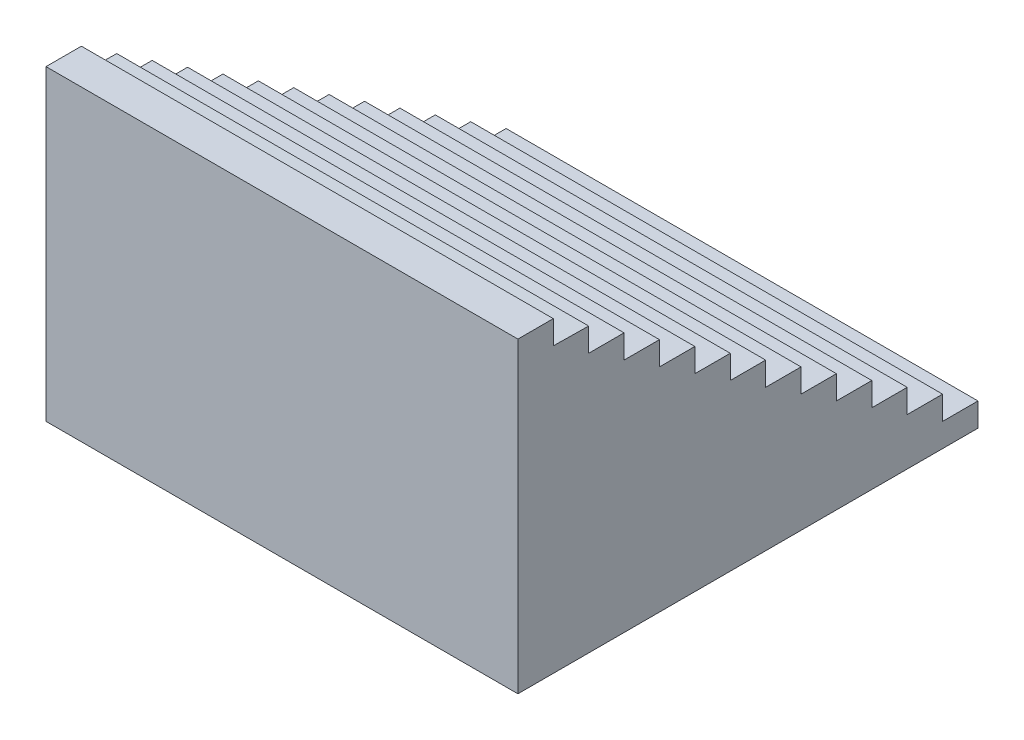
ISO-10303-21;
HEADER;
FILE_DESCRIPTION(('STEP AP214'),'2;1');
FILE_NAME('part.step','',(''),(''),'','','');
FILE_SCHEMA(('AUTOMOTIVE_DESIGN { 1 0 10303 214 1 1 1 1 }'));
ENDSEC;
DATA;
#1=APPLICATION_CONTEXT('core data for automotive mechanical design processes');
#2=APPLICATION_PROTOCOL_DEFINITION('international standard','automotive_design',2000,#1);
#3=PRODUCT_CONTEXT('',#1,'mechanical');
#4=PRODUCT('Part','Part','',(#3));
#5=PRODUCT_RELATED_PRODUCT_CATEGORY('part','',(#4));
#6=PRODUCT_DEFINITION_FORMATION('','',#4);
#7=PRODUCT_DEFINITION_CONTEXT('part definition',#1,'design');
#8=PRODUCT_DEFINITION('design','',#6,#7);
#9=PRODUCT_DEFINITION_SHAPE('','',#8);
#10=(LENGTH_UNIT() NAMED_UNIT(*) SI_UNIT(.MILLI.,.METRE.));
#11=(NAMED_UNIT(*) PLANE_ANGLE_UNIT() SI_UNIT($,.RADIAN.));
#12=(NAMED_UNIT(*) SI_UNIT($,.STERADIAN.) SOLID_ANGLE_UNIT());
#13=UNCERTAINTY_MEASURE_WITH_UNIT(LENGTH_MEASURE(1.E-05),#10,'distance_accuracy_value','');
#14=(GEOMETRIC_REPRESENTATION_CONTEXT(3) GLOBAL_UNCERTAINTY_ASSIGNED_CONTEXT((#13)) GLOBAL_UNIT_ASSIGNED_CONTEXT((#10,
#11,#12)) REPRESENTATION_CONTEXT('',''));
#15=CARTESIAN_POINT('',(0.,0.,0.));
#16=DIRECTION('',(0.,0.,1.));
#17=DIRECTION('',(1.,0.,0.));
#18=AXIS2_PLACEMENT_3D('',#15,#16,#17);
#19=CARTESIAN_POINT('',(-200.,65.2131457703675,60.));
#20=DIRECTION('',(0.,0.,-1.));
#21=DIRECTION('',(-1.,0.,0.));
#22=AXIS2_PLACEMENT_3D('',#19,#20,#21);
#23=PLANE('',#22);
#24=DIRECTION('',(0.,1.,0.));
#25=VECTOR('',#24,1.);
#26=CARTESIAN_POINT('',(0.,65.2131457703675,60.));
#27=LINE('',#26,#25);
#28=CARTESIAN_POINT('',(0.,55.2131457703675,60.));
#29=VERTEX_POINT('',#28);
#30=CARTESIAN_POINT('',(0.,65.2131457703675,60.));
#31=VERTEX_POINT('',#30);
#32=EDGE_CURVE('E262',#29,#31,#27,.T.);
#33=ORIENTED_EDGE('',*,*,#32,.F.);
#34=DIRECTION('',(1.,0.,0.));
#35=VECTOR('',#34,1.);
#36=CARTESIAN_POINT('',(-200.,55.2131457703675,60.));
#37=LINE('',#36,#35);
#38=CARTESIAN_POINT('',(-200.,55.2131457703675,60.));
#39=VERTEX_POINT('',#38);
#40=EDGE_CURVE('E11',#39,#29,#37,.T.);
#41=ORIENTED_EDGE('',*,*,#40,.F.);
#42=DIRECTION('',(0.,1.,0.));
#43=VECTOR('',#42,1.);
#44=CARTESIAN_POINT('',(-200.,65.2131457703675,60.));
#45=LINE('',#44,#43);
#46=CARTESIAN_POINT('',(-200.,65.2131457703675,60.));
#47=VERTEX_POINT('',#46);
#48=EDGE_CURVE('E370',#39,#47,#45,.T.);
#49=ORIENTED_EDGE('',*,*,#48,.T.);
#50=DIRECTION('',(1.,0.,0.));
#51=VECTOR('',#50,1.);
#52=CARTESIAN_POINT('',(-200.,65.2131457703675,60.));
#53=LINE('',#52,#51);
#54=EDGE_CURVE('E42',#47,#31,#53,.T.);
#55=ORIENTED_EDGE('',*,*,#54,.T.);
#56=EDGE_LOOP('',(#33,#41,#49,#55));
#57=FACE_BOUND('',#56,.T.);
#58=ADVANCED_FACE('F39',(#57),#23,.T.);
#59=CARTESIAN_POINT('',(-200.,55.2131457703675,60.));
#60=DIRECTION('',(0.,0.99989905724305,-0.0142082836563894));
#61=DIRECTION('',(0.,0.0142082836563894,0.99989905724305));
#62=AXIS2_PLACEMENT_3D('',#59,#60,#61);
#63=PLANE('',#62);
#64=DIRECTION('',(0.,0.0142082836563894,0.99989905724305));
#65=VECTOR('',#64,1.);
#66=CARTESIAN_POINT('',(0.,55.2131457703675,60.));
#67=LINE('',#66,#65);
#68=CARTESIAN_POINT('',(0.,55.0000215155217,45.0015141413543));
#69=VERTEX_POINT('',#68);
#70=EDGE_CURVE('E367',#69,#29,#67,.T.);
#71=ORIENTED_EDGE('',*,*,#70,.F.);
#72=DIRECTION('',(1.,0.,0.));
#73=VECTOR('',#72,1.);
#74=CARTESIAN_POINT('',(-200.,55.0000215155217,45.0015141413543));
#75=LINE('',#74,#73);
#76=CARTESIAN_POINT('',(-200.,55.0000215155217,45.0015141413543));
#77=VERTEX_POINT('',#76);
#78=EDGE_CURVE('E49',#77,#69,#75,.T.);
#79=ORIENTED_EDGE('',*,*,#78,.F.);
#80=DIRECTION('',(0.,0.0142082836563894,0.99989905724305));
#81=VECTOR('',#80,1.);
#82=CARTESIAN_POINT('',(-200.,55.2131457703675,60.));
#83=LINE('',#82,#81);
#84=EDGE_CURVE('E248',#77,#39,#83,.T.);
#85=ORIENTED_EDGE('',*,*,#84,.T.);
#86=ORIENTED_EDGE('',*,*,#40,.T.);
#87=EDGE_LOOP('',(#71,#79,#85,#86));
#88=FACE_BOUND('',#87,.T.);
#89=ADVANCED_FACE('F448',(#88),#63,.T.);
#90=CARTESIAN_POINT('',(-200.,55.0000215155217,45.0015141413543));
#91=DIRECTION('',(0.,0.,-1.));
#92=DIRECTION('',(-1.,0.,0.));
#93=AXIS2_PLACEMENT_3D('',#90,#91,#92);
#94=PLANE('',#93);
#95=DIRECTION('',(0.,1.,0.));
#96=VECTOR('',#95,1.);
#97=CARTESIAN_POINT('',(0.,55.0000215155217,45.0015141413543));
#98=LINE('',#97,#96);
#99=CARTESIAN_POINT('',(0.,45.0000215155217,45.0015141413543));
#100=VERTEX_POINT('',#99);
#101=EDGE_CURVE('E234',#100,#69,#98,.T.);
#102=ORIENTED_EDGE('',*,*,#101,.F.);
#103=DIRECTION('',(1.,0.,0.));
#104=VECTOR('',#103,1.);
#105=CARTESIAN_POINT('',(-200.,45.0000215155217,45.0015141413543));
#106=LINE('',#105,#104);
#107=CARTESIAN_POINT('',(-200.,45.0000215155217,45.0015141413543));
#108=VERTEX_POINT('',#107);
#109=EDGE_CURVE('E229',#108,#100,#106,.T.);
#110=ORIENTED_EDGE('',*,*,#109,.F.);
#111=DIRECTION('',(0.,1.,0.));
#112=VECTOR('',#111,1.);
#113=CARTESIAN_POINT('',(-200.,55.0000215155217,45.0015141413543));
#114=LINE('',#113,#112);
#115=EDGE_CURVE('E232',#108,#77,#114,.T.);
#116=ORIENTED_EDGE('',*,*,#115,.T.);
#117=ORIENTED_EDGE('',*,*,#78,.T.);
#118=EDGE_LOOP('',(#102,#110,#116,#117));
#119=FACE_BOUND('',#118,.T.);
#120=ADVANCED_FACE('F231',(#119),#94,.T.);
#121=CARTESIAN_POINT('',(-200.,45.0000215155217,45.0015141413543));
#122=DIRECTION('',(0.,1.,0.));
#123=DIRECTION('',(0.,0.,1.));
#124=AXIS2_PLACEMENT_3D('',#121,#122,#123);
#125=PLANE('',#124);
#126=DIRECTION('',(0.,0.,1.));
#127=VECTOR('',#126,1.);
#128=CARTESIAN_POINT('',(0.,45.0000215155217,45.0015141413543));
#129=LINE('',#128,#127);
#130=CARTESIAN_POINT('',(0.,45.0000215155217,30.0015141413543));
#131=VERTEX_POINT('',#130);
#132=EDGE_CURVE('E362',#131,#100,#129,.T.);
#133=ORIENTED_EDGE('',*,*,#132,.F.);
#134=DIRECTION('',(1.,0.,0.));
#135=VECTOR('',#134,1.);
#136=CARTESIAN_POINT('',(-200.,45.0000215155217,30.0015141413543));
#137=LINE('',#136,#135);
#138=CARTESIAN_POINT('',(-200.,45.0000215155217,30.0015141413543));
#139=VERTEX_POINT('',#138);
#140=EDGE_CURVE('E240',#139,#131,#137,.T.);
#141=ORIENTED_EDGE('',*,*,#140,.F.);
#142=DIRECTION('',(0.,0.,1.));
#143=VECTOR('',#142,1.);
#144=CARTESIAN_POINT('',(-200.,45.0000215155217,45.0015141413543));
#145=LINE('',#144,#143);
#146=EDGE_CURVE('E246',#139,#108,#145,.T.);
#147=ORIENTED_EDGE('',*,*,#146,.T.);
#148=ORIENTED_EDGE('',*,*,#109,.T.);
#149=EDGE_LOOP('',(#133,#141,#147,#148));
#150=FACE_BOUND('',#149,.T.);
#151=ADVANCED_FACE('F251',(#150),#125,.T.);
#152=CARTESIAN_POINT('',(-200.,45.0000215155217,30.0015141413543));
#153=DIRECTION('',(0.,0.,-1.));
#154=DIRECTION('',(-1.,0.,0.));
#155=AXIS2_PLACEMENT_3D('',#152,#153,#154);
#156=PLANE('',#155);
#157=DIRECTION('',(0.,1.,0.));
#158=VECTOR('',#157,1.);
#159=CARTESIAN_POINT('',(0.,45.0000215155217,30.0015141413543));
#160=LINE('',#159,#158);
#161=CARTESIAN_POINT('',(0.,35.0000215155217,30.0015141413543));
#162=VERTEX_POINT('',#161);
#163=EDGE_CURVE('E358',#162,#131,#160,.T.);
#164=ORIENTED_EDGE('',*,*,#163,.F.);
#165=DIRECTION('',(1.,0.,0.));
#166=VECTOR('',#165,1.);
#167=CARTESIAN_POINT('',(-200.,35.0000215155217,30.0015141413543));
#168=LINE('',#167,#166);
#169=CARTESIAN_POINT('',(-200.,35.0000215155217,30.0015141413543));
#170=VERTEX_POINT('',#169);
#171=EDGE_CURVE('E376',#170,#162,#168,.T.);
#172=ORIENTED_EDGE('',*,*,#171,.F.);
#173=DIRECTION('',(0.,1.,0.));
#174=VECTOR('',#173,1.);
#175=CARTESIAN_POINT('',(-200.,45.0000215155217,30.0015141413543));
#176=LINE('',#175,#174);
#177=EDGE_CURVE('E253',#170,#139,#176,.T.);
#178=ORIENTED_EDGE('',*,*,#177,.T.);
#179=ORIENTED_EDGE('',*,*,#140,.T.);
#180=EDGE_LOOP('',(#164,#172,#178,#179));
#181=FACE_BOUND('',#180,.T.);
#182=ADVANCED_FACE('F461',(#181),#156,.T.);
#183=CARTESIAN_POINT('',(-200.,35.0000215155217,30.0015141413543));
#184=DIRECTION('',(0.,1.,0.));
#185=DIRECTION('',(0.,0.,1.));
#186=AXIS2_PLACEMENT_3D('',#183,#184,#185);
#187=PLANE('',#186);
#188=DIRECTION('',(0.,0.,1.));
#189=VECTOR('',#188,1.);
#190=CARTESIAN_POINT('',(0.,35.0000215155217,30.0015141413543));
#191=LINE('',#190,#189);
#192=CARTESIAN_POINT('',(0.,35.0000215155217,15.0015141413543));
#193=VERTEX_POINT('',#192);
#194=EDGE_CURVE('E354',#193,#162,#191,.T.);
#195=ORIENTED_EDGE('',*,*,#194,.F.);
#196=DIRECTION('',(1.,0.,0.));
#197=VECTOR('',#196,1.);
#198=CARTESIAN_POINT('',(-200.,35.0000215155217,15.0015141413543));
#199=LINE('',#198,#197);
#200=CARTESIAN_POINT('',(-200.,35.0000215155217,15.0015141413543));
#201=VERTEX_POINT('',#200);
#202=EDGE_CURVE('E379',#201,#193,#199,.T.);
#203=ORIENTED_EDGE('',*,*,#202,.F.);
#204=DIRECTION('',(0.,0.,1.));
#205=VECTOR('',#204,1.);
#206=CARTESIAN_POINT('',(-200.,35.0000215155217,30.0015141413543));
#207=LINE('',#206,#205);
#208=EDGE_CURVE('E256',#201,#170,#207,.T.);
#209=ORIENTED_EDGE('',*,*,#208,.T.);
#210=ORIENTED_EDGE('',*,*,#171,.T.);
#211=EDGE_LOOP('',(#195,#203,#209,#210));
#212=FACE_BOUND('',#211,.T.);
#213=ADVANCED_FACE('F464',(#212),#187,.T.);
#214=CARTESIAN_POINT('',(-200.,35.0000215155217,15.0015141413543));
#215=DIRECTION('',(0.,0.,-1.));
#216=DIRECTION('',(-1.,0.,0.));
#217=AXIS2_PLACEMENT_3D('',#214,#215,#216);
#218=PLANE('',#217);
#219=DIRECTION('',(0.,1.,0.));
#220=VECTOR('',#219,1.);
#221=CARTESIAN_POINT('',(0.,35.0000215155217,15.0015141413543));
#222=LINE('',#221,#220);
#223=CARTESIAN_POINT('',(0.,25.0000215155217,15.0015141413543));
#224=VERTEX_POINT('',#223);
#225=EDGE_CURVE('E350',#224,#193,#222,.T.);
#226=ORIENTED_EDGE('',*,*,#225,.F.);
#227=DIRECTION('',(1.,0.,0.));
#228=VECTOR('',#227,1.);
#229=CARTESIAN_POINT('',(-200.,25.0000215155217,15.0015141413543));
#230=LINE('',#229,#228);
#231=CARTESIAN_POINT('',(-200.,25.0000215155217,15.0015141413543));
#232=VERTEX_POINT('',#231);
#233=EDGE_CURVE('E382',#232,#224,#230,.T.);
#234=ORIENTED_EDGE('',*,*,#233,.F.);
#235=DIRECTION('',(0.,1.,0.));
#236=VECTOR('',#235,1.);
#237=CARTESIAN_POINT('',(-200.,35.0000215155217,15.0015141413543));
#238=LINE('',#237,#236);
#239=EDGE_CURVE('E809',#232,#201,#238,.T.);
#240=ORIENTED_EDGE('',*,*,#239,.T.);
#241=ORIENTED_EDGE('',*,*,#202,.T.);
#242=EDGE_LOOP('',(#226,#234,#240,#241));
#243=FACE_BOUND('',#242,.T.);
#244=ADVANCED_FACE('F468',(#243),#218,.T.);
#245=CARTESIAN_POINT('',(-200.,25.0000215155217,15.0015141413543));
#246=DIRECTION('',(0.,1.,0.));
#247=DIRECTION('',(0.,0.,1.));
#248=AXIS2_PLACEMENT_3D('',#245,#246,#247);
#249=PLANE('',#248);
#250=DIRECTION('',(0.,0.,1.));
#251=VECTOR('',#250,1.);
#252=CARTESIAN_POINT('',(0.,25.0000215155217,15.0015141413543));
#253=LINE('',#252,#251);
#254=CARTESIAN_POINT('',(0.,25.0000215155217,0.00151414135425576));
#255=VERTEX_POINT('',#254);
#256=EDGE_CURVE('E346',#255,#224,#253,.T.);
#257=ORIENTED_EDGE('',*,*,#256,.F.);
#258=DIRECTION('',(1.,0.,0.));
#259=VECTOR('',#258,1.);
#260=CARTESIAN_POINT('',(-200.,25.0000215155217,0.00151414135425576));
#261=LINE('',#260,#259);
#262=CARTESIAN_POINT('',(-200.,25.0000215155217,0.00151414135425576));
#263=VERTEX_POINT('',#262);
#264=EDGE_CURVE('E385',#263,#255,#261,.T.);
#265=ORIENTED_EDGE('',*,*,#264,.F.);
#266=DIRECTION('',(0.,0.,1.));
#267=VECTOR('',#266,1.);
#268=CARTESIAN_POINT('',(-200.,25.0000215155217,15.0015141413543));
#269=LINE('',#268,#267);
#270=EDGE_CURVE('E805',#263,#232,#269,.T.);
#271=ORIENTED_EDGE('',*,*,#270,.T.);
#272=ORIENTED_EDGE('',*,*,#233,.T.);
#273=EDGE_LOOP('',(#257,#265,#271,#272));
#274=FACE_BOUND('',#273,.T.);
#275=ADVANCED_FACE('F472',(#274),#249,.T.);
#276=CARTESIAN_POINT('',(-200.,25.0000215155217,0.00151414135425576));
#277=DIRECTION('',(0.,0.,-1.));
#278=DIRECTION('',(0.,1.,0.));
#279=AXIS2_PLACEMENT_3D('',#276,#277,#278);
#280=PLANE('',#279);
#281=DIRECTION('',(0.,1.,0.));
#282=VECTOR('',#281,1.);
#283=CARTESIAN_POINT('',(0.,25.0000215155217,0.00151414135425576));
#284=LINE('',#283,#282);
#285=CARTESIAN_POINT('',(0.,15.0000215155217,0.00151414135425454));
#286=VERTEX_POINT('',#285);
#287=EDGE_CURVE('E342',#286,#255,#284,.T.);
#288=ORIENTED_EDGE('',*,*,#287,.F.);
#289=DIRECTION('',(1.,0.,0.));
#290=VECTOR('',#289,1.);
#291=CARTESIAN_POINT('',(-200.,15.0000215155217,0.00151414135425454));
#292=LINE('',#291,#290);
#293=CARTESIAN_POINT('',(-200.,15.0000215155217,0.00151414135425454));
#294=VERTEX_POINT('',#293);
#295=EDGE_CURVE('E388',#294,#286,#292,.T.);
#296=ORIENTED_EDGE('',*,*,#295,.F.);
#297=DIRECTION('',(0.,1.,0.));
#298=VECTOR('',#297,1.);
#299=CARTESIAN_POINT('',(-200.,25.0000215155217,0.00151414135425576));
#300=LINE('',#299,#298);
#301=EDGE_CURVE('E819',#294,#263,#300,.T.);
#302=ORIENTED_EDGE('',*,*,#301,.T.);
#303=ORIENTED_EDGE('',*,*,#264,.T.);
#304=EDGE_LOOP('',(#288,#296,#302,#303));
#305=FACE_BOUND('',#304,.T.);
#306=ADVANCED_FACE('F476',(#305),#280,.T.);
#307=CARTESIAN_POINT('',(-200.,15.0000215155217,0.00151414135425454));
#308=DIRECTION('',(0.,1.,0.));
#309=DIRECTION('',(0.,0.,1.));
#310=AXIS2_PLACEMENT_3D('',#307,#308,#309);
#311=PLANE('',#310);
#312=DIRECTION('',(0.,0.,1.));
#313=VECTOR('',#312,1.);
#314=CARTESIAN_POINT('',(0.,15.0000215155217,0.00151414135425454));
#315=LINE('',#314,#313);
#316=CARTESIAN_POINT('',(0.,15.0000215155217,-14.9984858586457));
#317=VERTEX_POINT('',#316);
#318=EDGE_CURVE('E338',#317,#286,#315,.T.);
#319=ORIENTED_EDGE('',*,*,#318,.F.);
#320=DIRECTION('',(1.,0.,0.));
#321=VECTOR('',#320,1.);
#322=CARTESIAN_POINT('',(-200.,15.0000215155217,-14.9984858586457));
#323=LINE('',#322,#321);
#324=CARTESIAN_POINT('',(-200.,15.0000215155217,-14.9984858586457));
#325=VERTEX_POINT('',#324);
#326=EDGE_CURVE('E391',#325,#317,#323,.T.);
#327=ORIENTED_EDGE('',*,*,#326,.F.);
#328=DIRECTION('',(0.,0.,1.));
#329=VECTOR('',#328,1.);
#330=CARTESIAN_POINT('',(-200.,15.0000215155217,0.00151414135425454));
#331=LINE('',#330,#329);
#332=EDGE_CURVE('E798',#325,#294,#331,.T.);
#333=ORIENTED_EDGE('',*,*,#332,.T.);
#334=ORIENTED_EDGE('',*,*,#295,.T.);
#335=EDGE_LOOP('',(#319,#327,#333,#334));
#336=FACE_BOUND('',#335,.T.);
#337=ADVANCED_FACE('F480',(#336),#311,.T.);
#338=CARTESIAN_POINT('',(-200.,15.0000215155217,-14.9984858586457));
#339=DIRECTION('',(0.,0.,-1.));
#340=DIRECTION('',(0.,1.,0.));
#341=AXIS2_PLACEMENT_3D('',#338,#339,#340);
#342=PLANE('',#341);
#343=DIRECTION('',(0.,1.,0.));
#344=VECTOR('',#343,1.);
#345=CARTESIAN_POINT('',(0.,15.0000215155217,-14.9984858586457));
#346=LINE('',#345,#344);
#347=CARTESIAN_POINT('',(0.,5.00002151552168,-14.9984858586457));
#348=VERTEX_POINT('',#347);
#349=EDGE_CURVE('E334',#348,#317,#346,.T.);
#350=ORIENTED_EDGE('',*,*,#349,.F.);
#351=DIRECTION('',(1.,0.,0.));
#352=VECTOR('',#351,1.);
#353=CARTESIAN_POINT('',(-200.,5.00002151552168,-14.9984858586457));
#354=LINE('',#353,#352);
#355=CARTESIAN_POINT('',(-200.,5.00002151552168,-14.9984858586457));
#356=VERTEX_POINT('',#355);
#357=EDGE_CURVE('E394',#356,#348,#354,.T.);
#358=ORIENTED_EDGE('',*,*,#357,.F.);
#359=DIRECTION('',(0.,1.,0.));
#360=VECTOR('',#359,1.);
#361=CARTESIAN_POINT('',(-200.,15.0000215155217,-14.9984858586457));
#362=LINE('',#361,#360);
#363=EDGE_CURVE('E794',#356,#325,#362,.T.);
#364=ORIENTED_EDGE('',*,*,#363,.T.);
#365=ORIENTED_EDGE('',*,*,#326,.T.);
#366=EDGE_LOOP('',(#350,#358,#364,#365));
#367=FACE_BOUND('',#366,.T.);
#368=ADVANCED_FACE('F484',(#367),#342,.T.);
#369=CARTESIAN_POINT('',(-200.,5.00002151552168,-14.9984858586457));
#370=DIRECTION('',(0.,1.,0.));
#371=DIRECTION('',(0.,0.,1.));
#372=AXIS2_PLACEMENT_3D('',#369,#370,#371);
#373=PLANE('',#372);
#374=DIRECTION('',(0.,0.,1.));
#375=VECTOR('',#374,1.);
#376=CARTESIAN_POINT('',(0.,5.00002151552168,-14.9984858586457));
#377=LINE('',#376,#375);
#378=CARTESIAN_POINT('',(0.,5.00002151552168,-29.9984858586458));
#379=VERTEX_POINT('',#378);
#380=EDGE_CURVE('E330',#379,#348,#377,.T.);
#381=ORIENTED_EDGE('',*,*,#380,.F.);
#382=DIRECTION('',(1.,0.,0.));
#383=VECTOR('',#382,1.);
#384=CARTESIAN_POINT('',(-200.,5.00002151552168,-29.9984858586458));
#385=LINE('',#384,#383);
#386=CARTESIAN_POINT('',(-200.,5.00002151552168,-29.9984858586458));
#387=VERTEX_POINT('',#386);
#388=EDGE_CURVE('E397',#387,#379,#385,.T.);
#389=ORIENTED_EDGE('',*,*,#388,.F.);
#390=DIRECTION('',(0.,0.,1.));
#391=VECTOR('',#390,1.);
#392=CARTESIAN_POINT('',(-200.,5.00002151552168,-14.9984858586457));
#393=LINE('',#392,#391);
#394=EDGE_CURVE('E826',#387,#356,#393,.T.);
#395=ORIENTED_EDGE('',*,*,#394,.T.);
#396=ORIENTED_EDGE('',*,*,#357,.T.);
#397=EDGE_LOOP('',(#381,#389,#395,#396));
#398=FACE_BOUND('',#397,.T.);
#399=ADVANCED_FACE('F488',(#398),#373,.T.);
#400=CARTESIAN_POINT('',(-200.,5.00002151552168,-29.9984858586458));
#401=DIRECTION('',(0.,0.,-1.));
#402=DIRECTION('',(-1.,0.,0.));
#403=AXIS2_PLACEMENT_3D('',#400,#401,#402);
#404=PLANE('',#403);
#405=DIRECTION('',(0.,1.,0.));
#406=VECTOR('',#405,1.);
#407=CARTESIAN_POINT('',(0.,5.00002151552168,-29.9984858586458));
#408=LINE('',#407,#406);
#409=CARTESIAN_POINT('',(0.,-4.99997848447832,-29.9984858586458));
#410=VERTEX_POINT('',#409);
#411=EDGE_CURVE('E326',#410,#379,#408,.T.);
#412=ORIENTED_EDGE('',*,*,#411,.F.);
#413=DIRECTION('',(1.,0.,0.));
#414=VECTOR('',#413,1.);
#415=CARTESIAN_POINT('',(-200.,-4.99997848447832,-29.9984858586458));
#416=LINE('',#415,#414);
#417=CARTESIAN_POINT('',(-200.,-4.99997848447832,-29.9984858586458));
#418=VERTEX_POINT('',#417);
#419=EDGE_CURVE('E400',#418,#410,#416,.T.);
#420=ORIENTED_EDGE('',*,*,#419,.F.);
#421=DIRECTION('',(0.,1.,0.));
#422=VECTOR('',#421,1.);
#423=CARTESIAN_POINT('',(-200.,5.00002151552168,-29.9984858586458));
#424=LINE('',#423,#422);
#425=EDGE_CURVE('E787',#418,#387,#424,.T.);
#426=ORIENTED_EDGE('',*,*,#425,.T.);
#427=ORIENTED_EDGE('',*,*,#388,.T.);
#428=EDGE_LOOP('',(#412,#420,#426,#427));
#429=FACE_BOUND('',#428,.T.);
#430=ADVANCED_FACE('F492',(#429),#404,.T.);
#431=CARTESIAN_POINT('',(-200.,-4.99997848447832,-29.9984858586458));
#432=DIRECTION('',(0.,1.,0.));
#433=DIRECTION('',(0.,0.,1.));
#434=AXIS2_PLACEMENT_3D('',#431,#432,#433);
#435=PLANE('',#434);
#436=DIRECTION('',(0.,0.,1.));
#437=VECTOR('',#436,1.);
#438=CARTESIAN_POINT('',(0.,-4.99997848447832,-29.9984858586458));
#439=LINE('',#438,#437);
#440=CARTESIAN_POINT('',(0.,-4.99997848447832,-44.9984858586458));
#441=VERTEX_POINT('',#440);
#442=EDGE_CURVE('E322',#441,#410,#439,.T.);
#443=ORIENTED_EDGE('',*,*,#442,.F.);
#444=DIRECTION('',(1.,0.,0.));
#445=VECTOR('',#444,1.);
#446=CARTESIAN_POINT('',(-200.,-4.99997848447832,-44.9984858586458));
#447=LINE('',#446,#445);
#448=CARTESIAN_POINT('',(-200.,-4.99997848447832,-44.9984858586458));
#449=VERTEX_POINT('',#448);
#450=EDGE_CURVE('E403',#449,#441,#447,.T.);
#451=ORIENTED_EDGE('',*,*,#450,.F.);
#452=DIRECTION('',(0.,0.,1.));
#453=VECTOR('',#452,1.);
#454=CARTESIAN_POINT('',(-200.,-4.99997848447832,-29.9984858586458));
#455=LINE('',#454,#453);
#456=EDGE_CURVE('E783',#449,#418,#455,.T.);
#457=ORIENTED_EDGE('',*,*,#456,.T.);
#458=ORIENTED_EDGE('',*,*,#419,.T.);
#459=EDGE_LOOP('',(#443,#451,#457,#458));
#460=FACE_BOUND('',#459,.T.);
#461=ADVANCED_FACE('F496',(#460),#435,.T.);
#462=CARTESIAN_POINT('',(-200.,-4.99997848447832,-44.9984858586458));
#463=DIRECTION('',(0.,0.,-1.));
#464=DIRECTION('',(-1.,0.,0.));
#465=AXIS2_PLACEMENT_3D('',#462,#463,#464);
#466=PLANE('',#465);
#467=DIRECTION('',(0.,1.,0.));
#468=VECTOR('',#467,1.);
#469=CARTESIAN_POINT('',(0.,-4.99997848447832,-44.9984858586458));
#470=LINE('',#469,#468);
#471=CARTESIAN_POINT('',(0.,-14.9999784844783,-44.9984858586458));
#472=VERTEX_POINT('',#471);
#473=EDGE_CURVE('E318',#472,#441,#470,.T.);
#474=ORIENTED_EDGE('',*,*,#473,.F.);
#475=DIRECTION('',(1.,0.,0.));
#476=VECTOR('',#475,1.);
#477=CARTESIAN_POINT('',(-200.,-14.9999784844783,-44.9984858586458));
#478=LINE('',#477,#476);
#479=CARTESIAN_POINT('',(-200.,-14.9999784844783,-44.9984858586458));
#480=VERTEX_POINT('',#479);
#481=EDGE_CURVE('E406',#480,#472,#478,.T.);
#482=ORIENTED_EDGE('',*,*,#481,.F.);
#483=DIRECTION('',(0.,1.,0.));
#484=VECTOR('',#483,1.);
#485=CARTESIAN_POINT('',(-200.,-4.99997848447832,-44.9984858586458));
#486=LINE('',#485,#484);
#487=EDGE_CURVE('E833',#480,#449,#486,.T.);
#488=ORIENTED_EDGE('',*,*,#487,.T.);
#489=ORIENTED_EDGE('',*,*,#450,.T.);
#490=EDGE_LOOP('',(#474,#482,#488,#489));
#491=FACE_BOUND('',#490,.T.);
#492=ADVANCED_FACE('F500',(#491),#466,.T.);
#493=CARTESIAN_POINT('',(-200.,-14.9999784844783,-44.9984858586458));
#494=DIRECTION('',(0.,1.,0.));
#495=DIRECTION('',(0.,0.,1.));
#496=AXIS2_PLACEMENT_3D('',#493,#494,#495);
#497=PLANE('',#496);
#498=DIRECTION('',(0.,0.,1.));
#499=VECTOR('',#498,1.);
#500=CARTESIAN_POINT('',(0.,-14.9999784844783,-44.9984858586458));
#501=LINE('',#500,#499);
#502=CARTESIAN_POINT('',(0.,-14.9999784844783,-59.9984858586458));
#503=VERTEX_POINT('',#502);
#504=EDGE_CURVE('E314',#503,#472,#501,.T.);
#505=ORIENTED_EDGE('',*,*,#504,.F.);
#506=DIRECTION('',(1.,0.,0.));
#507=VECTOR('',#506,1.);
#508=CARTESIAN_POINT('',(-200.,-14.9999784844783,-59.9984858586458));
#509=LINE('',#508,#507);
#510=CARTESIAN_POINT('',(-200.,-14.9999784844783,-59.9984858586458));
#511=VERTEX_POINT('',#510);
#512=EDGE_CURVE('E409',#511,#503,#509,.T.);
#513=ORIENTED_EDGE('',*,*,#512,.F.);
#514=DIRECTION('',(0.,0.,1.));
#515=VECTOR('',#514,1.);
#516=CARTESIAN_POINT('',(-200.,-14.9999784844783,-44.9984858586458));
#517=LINE('',#516,#515);
#518=EDGE_CURVE('E776',#511,#480,#517,.T.);
#519=ORIENTED_EDGE('',*,*,#518,.T.);
#520=ORIENTED_EDGE('',*,*,#481,.T.);
#521=EDGE_LOOP('',(#505,#513,#519,#520));
#522=FACE_BOUND('',#521,.T.);
#523=ADVANCED_FACE('F504',(#522),#497,.T.);
#524=CARTESIAN_POINT('',(-200.,-14.9999784844783,-59.9984858586458));
#525=DIRECTION('',(0.,0.,-1.));
#526=DIRECTION('',(-1.,0.,0.));
#527=AXIS2_PLACEMENT_3D('',#524,#525,#526);
#528=PLANE('',#527);
#529=DIRECTION('',(0.,1.,0.));
#530=VECTOR('',#529,1.);
#531=CARTESIAN_POINT('',(0.,-14.9999784844783,-59.9984858586458));
#532=LINE('',#531,#530);
#533=CARTESIAN_POINT('',(0.,-24.9999784844783,-59.9984858586458));
#534=VERTEX_POINT('',#533);
#535=EDGE_CURVE('E310',#534,#503,#532,.T.);
#536=ORIENTED_EDGE('',*,*,#535,.F.);
#537=DIRECTION('',(1.,0.,0.));
#538=VECTOR('',#537,1.);
#539=CARTESIAN_POINT('',(-200.,-24.9999784844783,-59.9984858586458));
#540=LINE('',#539,#538);
#541=CARTESIAN_POINT('',(-200.,-24.9999784844783,-59.9984858586458));
#542=VERTEX_POINT('',#541);
#543=EDGE_CURVE('E412',#542,#534,#540,.T.);
#544=ORIENTED_EDGE('',*,*,#543,.F.);
#545=DIRECTION('',(0.,1.,0.));
#546=VECTOR('',#545,1.);
#547=CARTESIAN_POINT('',(-200.,-14.9999784844783,-59.9984858586458));
#548=LINE('',#547,#546);
#549=EDGE_CURVE('E772',#542,#511,#548,.T.);
#550=ORIENTED_EDGE('',*,*,#549,.T.);
#551=ORIENTED_EDGE('',*,*,#512,.T.);
#552=EDGE_LOOP('',(#536,#544,#550,#551));
#553=FACE_BOUND('',#552,.T.);
#554=ADVANCED_FACE('F508',(#553),#528,.T.);
#555=CARTESIAN_POINT('',(-200.,-24.9999784844783,-59.9984858586458));
#556=DIRECTION('',(0.,1.,0.));
#557=DIRECTION('',(0.,0.,1.));
#558=AXIS2_PLACEMENT_3D('',#555,#556,#557);
#559=PLANE('',#558);
#560=DIRECTION('',(0.,0.,1.));
#561=VECTOR('',#560,1.);
#562=CARTESIAN_POINT('',(0.,-24.9999784844783,-59.9984858586458));
#563=LINE('',#562,#561);
#564=CARTESIAN_POINT('',(0.,-24.9999784844783,-74.9984858586457));
#565=VERTEX_POINT('',#564);
#566=EDGE_CURVE('E306',#565,#534,#563,.T.);
#567=ORIENTED_EDGE('',*,*,#566,.F.);
#568=DIRECTION('',(1.,0.,0.));
#569=VECTOR('',#568,1.);
#570=CARTESIAN_POINT('',(-200.,-24.9999784844783,-74.9984858586457));
#571=LINE('',#570,#569);
#572=CARTESIAN_POINT('',(-200.,-24.9999784844783,-74.9984858586457));
#573=VERTEX_POINT('',#572);
#574=EDGE_CURVE('E415',#573,#565,#571,.T.);
#575=ORIENTED_EDGE('',*,*,#574,.F.);
#576=DIRECTION('',(0.,0.,1.));
#577=VECTOR('',#576,1.);
#578=CARTESIAN_POINT('',(-200.,-24.9999784844783,-59.9984858586458));
#579=LINE('',#578,#577);
#580=EDGE_CURVE('E840',#573,#542,#579,.T.);
#581=ORIENTED_EDGE('',*,*,#580,.T.);
#582=ORIENTED_EDGE('',*,*,#543,.T.);
#583=EDGE_LOOP('',(#567,#575,#581,#582));
#584=FACE_BOUND('',#583,.T.);
#585=ADVANCED_FACE('F512',(#584),#559,.T.);
#586=CARTESIAN_POINT('',(-200.,-24.9999784844783,-74.9984858586457));
#587=DIRECTION('',(0.,0.,-1.));
#588=DIRECTION('',(-1.,0.,0.));
#589=AXIS2_PLACEMENT_3D('',#586,#587,#588);
#590=PLANE('',#589);
#591=DIRECTION('',(0.,1.,0.));
#592=VECTOR('',#591,1.);
#593=CARTESIAN_POINT('',(0.,-24.9999784844783,-74.9984858586457));
#594=LINE('',#593,#592);
#595=CARTESIAN_POINT('',(0.,-34.9999784844783,-74.9984858586457));
#596=VERTEX_POINT('',#595);
#597=EDGE_CURVE('E302',#596,#565,#594,.T.);
#598=ORIENTED_EDGE('',*,*,#597,.F.);
#599=DIRECTION('',(1.,0.,0.));
#600=VECTOR('',#599,1.);
#601=CARTESIAN_POINT('',(-200.,-34.9999784844783,-74.9984858586457));
#602=LINE('',#601,#600);
#603=CARTESIAN_POINT('',(-200.,-34.9999784844783,-74.9984858586457));
#604=VERTEX_POINT('',#603);
#605=EDGE_CURVE('E418',#604,#596,#602,.T.);
#606=ORIENTED_EDGE('',*,*,#605,.F.);
#607=DIRECTION('',(0.,1.,0.));
#608=VECTOR('',#607,1.);
#609=CARTESIAN_POINT('',(-200.,-24.9999784844783,-74.9984858586457));
#610=LINE('',#609,#608);
#611=EDGE_CURVE('E765',#604,#573,#610,.T.);
#612=ORIENTED_EDGE('',*,*,#611,.T.);
#613=ORIENTED_EDGE('',*,*,#574,.T.);
#614=EDGE_LOOP('',(#598,#606,#612,#613));
#615=FACE_BOUND('',#614,.T.);
#616=ADVANCED_FACE('F516',(#615),#590,.T.);
#617=CARTESIAN_POINT('',(-200.,-34.9999784844783,-74.9984858586457));
#618=DIRECTION('',(0.,1.,0.));
#619=DIRECTION('',(0.,0.,1.));
#620=AXIS2_PLACEMENT_3D('',#617,#618,#619);
#621=PLANE('',#620);
#622=DIRECTION('',(0.,0.,1.));
#623=VECTOR('',#622,1.);
#624=CARTESIAN_POINT('',(0.,-34.9999784844783,-74.9984858586457));
#625=LINE('',#624,#623);
#626=CARTESIAN_POINT('',(0.,-34.9999784844783,-89.9984858586457));
#627=VERTEX_POINT('',#626);
#628=EDGE_CURVE('E298',#627,#596,#625,.T.);
#629=ORIENTED_EDGE('',*,*,#628,.F.);
#630=DIRECTION('',(1.,0.,0.));
#631=VECTOR('',#630,1.);
#632=CARTESIAN_POINT('',(-200.,-34.9999784844783,-89.9984858586457));
#633=LINE('',#632,#631);
#634=CARTESIAN_POINT('',(-200.,-34.9999784844783,-89.9984858586457));
#635=VERTEX_POINT('',#634);
#636=EDGE_CURVE('E421',#635,#627,#633,.T.);
#637=ORIENTED_EDGE('',*,*,#636,.F.);
#638=DIRECTION('',(0.,0.,1.));
#639=VECTOR('',#638,1.);
#640=CARTESIAN_POINT('',(-200.,-34.9999784844783,-74.9984858586457));
#641=LINE('',#640,#639);
#642=EDGE_CURVE('E761',#635,#604,#641,.T.);
#643=ORIENTED_EDGE('',*,*,#642,.T.);
#644=ORIENTED_EDGE('',*,*,#605,.T.);
#645=EDGE_LOOP('',(#629,#637,#643,#644));
#646=FACE_BOUND('',#645,.T.);
#647=ADVANCED_FACE('F520',(#646),#621,.T.);
#648=CARTESIAN_POINT('',(-200.,-34.9999784844783,-89.9984858586457));
#649=DIRECTION('',(0.,0.,-1.));
#650=DIRECTION('',(-1.,0.,0.));
#651=AXIS2_PLACEMENT_3D('',#648,#649,#650);
#652=PLANE('',#651);
#653=DIRECTION('',(0.,1.,0.));
#654=VECTOR('',#653,1.);
#655=CARTESIAN_POINT('',(0.,-34.9999784844783,-89.9984858586457));
#656=LINE('',#655,#654);
#657=CARTESIAN_POINT('',(0.,-44.9999784844783,-89.9984858586457));
#658=VERTEX_POINT('',#657);
#659=EDGE_CURVE('E294',#658,#627,#656,.T.);
#660=ORIENTED_EDGE('',*,*,#659,.F.);
#661=DIRECTION('',(1.,0.,0.));
#662=VECTOR('',#661,1.);
#663=CARTESIAN_POINT('',(-200.,-44.9999784844783,-89.9984858586457));
#664=LINE('',#663,#662);
#665=CARTESIAN_POINT('',(-200.,-44.9999784844783,-89.9984858586457));
#666=VERTEX_POINT('',#665);
#667=EDGE_CURVE('E424',#666,#658,#664,.T.);
#668=ORIENTED_EDGE('',*,*,#667,.F.);
#669=DIRECTION('',(0.,1.,0.));
#670=VECTOR('',#669,1.);
#671=CARTESIAN_POINT('',(-200.,-34.9999784844783,-89.9984858586457));
#672=LINE('',#671,#670);
#673=EDGE_CURVE('E847',#666,#635,#672,.T.);
#674=ORIENTED_EDGE('',*,*,#673,.T.);
#675=ORIENTED_EDGE('',*,*,#636,.T.);
#676=EDGE_LOOP('',(#660,#668,#674,#675));
#677=FACE_BOUND('',#676,.T.);
#678=ADVANCED_FACE('F524',(#677),#652,.T.);
#679=CARTESIAN_POINT('',(-200.,-44.9999784844783,-89.9984858586457));
#680=DIRECTION('',(0.,1.,0.));
#681=DIRECTION('',(0.,0.,1.));
#682=AXIS2_PLACEMENT_3D('',#679,#680,#681);
#683=PLANE('',#682);
#684=DIRECTION('',(0.,0.,1.));
#685=VECTOR('',#684,1.);
#686=CARTESIAN_POINT('',(0.,-44.9999784844783,-89.9984858586457));
#687=LINE('',#686,#685);
#688=CARTESIAN_POINT('',(0.,-44.9999784844783,-104.998485858646));
#689=VERTEX_POINT('',#688);
#690=EDGE_CURVE('E290',#689,#658,#687,.T.);
#691=ORIENTED_EDGE('',*,*,#690,.F.);
#692=DIRECTION('',(1.,0.,0.));
#693=VECTOR('',#692,1.);
#694=CARTESIAN_POINT('',(-200.,-44.9999784844783,-104.998485858646));
#695=LINE('',#694,#693);
#696=CARTESIAN_POINT('',(-200.,-44.9999784844783,-104.998485858646));
#697=VERTEX_POINT('',#696);
#698=EDGE_CURVE('E427',#697,#689,#695,.T.);
#699=ORIENTED_EDGE('',*,*,#698,.F.);
#700=DIRECTION('',(0.,0.,1.));
#701=VECTOR('',#700,1.);
#702=CARTESIAN_POINT('',(-200.,-44.9999784844783,-89.9984858586457));
#703=LINE('',#702,#701);
#704=EDGE_CURVE('E754',#697,#666,#703,.T.);
#705=ORIENTED_EDGE('',*,*,#704,.T.);
#706=ORIENTED_EDGE('',*,*,#667,.T.);
#707=EDGE_LOOP('',(#691,#699,#705,#706));
#708=FACE_BOUND('',#707,.T.);
#709=ADVANCED_FACE('F528',(#708),#683,.T.);
#710=CARTESIAN_POINT('',(-200.,-44.9999784844783,-104.998485858646));
#711=DIRECTION('',(0.,0.,-1.));
#712=DIRECTION('',(-1.,0.,0.));
#713=AXIS2_PLACEMENT_3D('',#710,#711,#712);
#714=PLANE('',#713);
#715=DIRECTION('',(0.,1.,0.));
#716=VECTOR('',#715,1.);
#717=CARTESIAN_POINT('',(0.,-44.9999784844783,-104.998485858646));
#718=LINE('',#717,#716);
#719=CARTESIAN_POINT('',(0.,-54.9999784844783,-104.998485858646));
#720=VERTEX_POINT('',#719);
#721=EDGE_CURVE('E286',#720,#689,#718,.T.);
#722=ORIENTED_EDGE('',*,*,#721,.F.);
#723=DIRECTION('',(1.,0.,0.));
#724=VECTOR('',#723,1.);
#725=CARTESIAN_POINT('',(-200.,-54.9999784844783,-104.998485858646));
#726=LINE('',#725,#724);
#727=CARTESIAN_POINT('',(-200.,-54.9999784844783,-104.998485858646));
#728=VERTEX_POINT('',#727);
#729=EDGE_CURVE('E430',#728,#720,#726,.T.);
#730=ORIENTED_EDGE('',*,*,#729,.F.);
#731=DIRECTION('',(0.,1.,0.));
#732=VECTOR('',#731,1.);
#733=CARTESIAN_POINT('',(-200.,-44.9999784844783,-104.998485858646));
#734=LINE('',#733,#732);
#735=EDGE_CURVE('E750',#728,#697,#734,.T.);
#736=ORIENTED_EDGE('',*,*,#735,.T.);
#737=ORIENTED_EDGE('',*,*,#698,.T.);
#738=EDGE_LOOP('',(#722,#730,#736,#737));
#739=FACE_BOUND('',#738,.T.);
#740=ADVANCED_FACE('F532',(#739),#714,.T.);
#741=CARTESIAN_POINT('',(-200.,-54.9999784844783,-104.998485858646));
#742=DIRECTION('',(0.,1.,0.));
#743=DIRECTION('',(0.,0.,1.));
#744=AXIS2_PLACEMENT_3D('',#741,#742,#743);
#745=PLANE('',#744);
#746=DIRECTION('',(0.,0.,1.));
#747=VECTOR('',#746,1.);
#748=CARTESIAN_POINT('',(0.,-54.9999784844783,-104.998485858646));
#749=LINE('',#748,#747);
#750=CARTESIAN_POINT('',(0.,-54.9999784844783,-119.998485858646));
#751=VERTEX_POINT('',#750);
#752=EDGE_CURVE('E282',#751,#720,#749,.T.);
#753=ORIENTED_EDGE('',*,*,#752,.F.);
#754=DIRECTION('',(1.,0.,0.));
#755=VECTOR('',#754,1.);
#756=CARTESIAN_POINT('',(-200.,-54.9999784844783,-119.998485858646));
#757=LINE('',#756,#755);
#758=CARTESIAN_POINT('',(-200.,-54.9999784844783,-119.998485858646));
#759=VERTEX_POINT('',#758);
#760=EDGE_CURVE('E433',#759,#751,#757,.T.);
#761=ORIENTED_EDGE('',*,*,#760,.F.);
#762=DIRECTION('',(0.,0.,1.));
#763=VECTOR('',#762,1.);
#764=CARTESIAN_POINT('',(-200.,-54.9999784844783,-104.998485858646));
#765=LINE('',#764,#763);
#766=EDGE_CURVE('E854',#759,#728,#765,.T.);
#767=ORIENTED_EDGE('',*,*,#766,.T.);
#768=ORIENTED_EDGE('',*,*,#729,.T.);
#769=EDGE_LOOP('',(#753,#761,#767,#768));
#770=FACE_BOUND('',#769,.T.);
#771=ADVANCED_FACE('F536',(#770),#745,.T.);
#772=CARTESIAN_POINT('',(-200.,-54.9999784844783,-119.998485858646));
#773=DIRECTION('',(0.,0.,-1.));
#774=DIRECTION('',(-1.,0.,0.));
#775=AXIS2_PLACEMENT_3D('',#772,#773,#774);
#776=PLANE('',#775);
#777=DIRECTION('',(0.,1.,0.));
#778=VECTOR('',#777,1.);
#779=CARTESIAN_POINT('',(0.,-54.9999784844783,-119.998485858646));
#780=LINE('',#779,#778);
#781=CARTESIAN_POINT('',(0.,-64.9999784844783,-119.998485858646));
#782=VERTEX_POINT('',#781);
#783=EDGE_CURVE('E278',#782,#751,#780,.T.);
#784=ORIENTED_EDGE('',*,*,#783,.F.);
#785=DIRECTION('',(1.,0.,0.));
#786=VECTOR('',#785,1.);
#787=CARTESIAN_POINT('',(-200.,-64.9999784844783,-119.998485858646));
#788=LINE('',#787,#786);
#789=CARTESIAN_POINT('',(-200.,-64.9999784844783,-119.998485858646));
#790=VERTEX_POINT('',#789);
#791=EDGE_CURVE('E436',#790,#782,#788,.T.);
#792=ORIENTED_EDGE('',*,*,#791,.F.);
#793=DIRECTION('',(0.,1.,0.));
#794=VECTOR('',#793,1.);
#795=CARTESIAN_POINT('',(-200.,-54.9999784844783,-119.998485858646));
#796=LINE('',#795,#794);
#797=EDGE_CURVE('E743',#790,#759,#796,.T.);
#798=ORIENTED_EDGE('',*,*,#797,.T.);
#799=ORIENTED_EDGE('',*,*,#760,.T.);
#800=EDGE_LOOP('',(#784,#792,#798,#799));
#801=FACE_BOUND('',#800,.T.);
#802=ADVANCED_FACE('F540',(#801),#776,.T.);
#803=CARTESIAN_POINT('',(-200.,-64.9999784844783,75.));
#804=DIRECTION('',(0.,-1.,0.));
#805=DIRECTION('',(0.,0.,-1.));
#806=AXIS2_PLACEMENT_3D('',#803,#804,#805);
#807=PLANE('',#806);
#808=DIRECTION('',(0.,0.,-1.));
#809=VECTOR('',#808,1.);
#810=CARTESIAN_POINT('',(0.,-64.9999784844783,75.));
#811=LINE('',#810,#809);
#812=CARTESIAN_POINT('',(0.,-64.9999784844783,75.));
#813=VERTEX_POINT('',#812);
#814=EDGE_CURVE('E274',#813,#782,#811,.T.);
#815=ORIENTED_EDGE('',*,*,#814,.F.);
#816=DIRECTION('',(1.,0.,0.));
#817=VECTOR('',#816,1.);
#818=CARTESIAN_POINT('',(-200.,-64.9999784844783,75.));
#819=LINE('',#818,#817);
#820=CARTESIAN_POINT('',(-200.,-64.9999784844783,75.));
#821=VERTEX_POINT('',#820);
#822=EDGE_CURVE('E439',#821,#813,#819,.T.);
#823=ORIENTED_EDGE('',*,*,#822,.F.);
#824=DIRECTION('',(0.,0.,-1.));
#825=VECTOR('',#824,1.);
#826=CARTESIAN_POINT('',(-200.,-64.9999784844783,75.));
#827=LINE('',#826,#825);
#828=EDGE_CURVE('E739',#821,#790,#827,.T.);
#829=ORIENTED_EDGE('',*,*,#828,.T.);
#830=ORIENTED_EDGE('',*,*,#791,.T.);
#831=EDGE_LOOP('',(#815,#823,#829,#830));
#832=FACE_BOUND('',#831,.T.);
#833=ADVANCED_FACE('F544',(#832),#807,.T.);
#834=CARTESIAN_POINT('',(-200.,65.2131457703675,75.));
#835=DIRECTION('',(0.,0.,1.));
#836=DIRECTION('',(0.,-1.,0.));
#837=AXIS2_PLACEMENT_3D('',#834,#835,#836);
#838=PLANE('',#837);
#839=DIRECTION('',(0.,-1.,0.));
#840=VECTOR('',#839,1.);
#841=CARTESIAN_POINT('',(0.,65.2131457703675,75.));
#842=LINE('',#841,#840);
#843=CARTESIAN_POINT('',(0.,65.2131457703675,75.));
#844=VERTEX_POINT('',#843);
#845=EDGE_CURVE('E270',#844,#813,#842,.T.);
#846=ORIENTED_EDGE('',*,*,#845,.F.);
#847=DIRECTION('',(1.,0.,0.));
#848=VECTOR('',#847,1.);
#849=CARTESIAN_POINT('',(-200.,65.2131457703675,75.));
#850=LINE('',#849,#848);
#851=CARTESIAN_POINT('',(-200.,65.2131457703675,75.));
#852=VERTEX_POINT('',#851);
#853=EDGE_CURVE('E441',#852,#844,#850,.T.);
#854=ORIENTED_EDGE('',*,*,#853,.F.);
#855=DIRECTION('',(0.,-1.,0.));
#856=VECTOR('',#855,1.);
#857=CARTESIAN_POINT('',(-200.,65.2131457703675,75.));
#858=LINE('',#857,#856);
#859=EDGE_CURVE('E861',#852,#821,#858,.T.);
#860=ORIENTED_EDGE('',*,*,#859,.T.);
#861=ORIENTED_EDGE('',*,*,#822,.T.);
#862=EDGE_LOOP('',(#846,#854,#860,#861));
#863=FACE_BOUND('',#862,.T.);
#864=ADVANCED_FACE('F548',(#863),#838,.T.);
#865=CARTESIAN_POINT('',(-200.,65.2131457703675,75.));
#866=DIRECTION('',(0.,1.,0.));
#867=DIRECTION('',(0.,0.,1.));
#868=AXIS2_PLACEMENT_3D('',#865,#866,#867);
#869=PLANE('',#868);
#870=DIRECTION('',(0.,0.,1.));
#871=VECTOR('',#870,1.);
#872=CARTESIAN_POINT('',(0.,65.2131457703675,75.));
#873=LINE('',#872,#871);
#874=EDGE_CURVE('E266',#31,#844,#873,.T.);
#875=ORIENTED_EDGE('',*,*,#874,.F.);
#876=ORIENTED_EDGE('',*,*,#54,.F.);
#877=DIRECTION('',(0.,0.,1.));
#878=VECTOR('',#877,1.);
#879=CARTESIAN_POINT('',(-200.,65.2131457703675,75.));
#880=LINE('',#879,#878);
#881=EDGE_CURVE('E864',#47,#852,#880,.T.);
#882=ORIENTED_EDGE('',*,*,#881,.T.);
#883=ORIENTED_EDGE('',*,*,#853,.T.);
#884=EDGE_LOOP('',(#875,#876,#882,#883));
#885=FACE_BOUND('',#884,.T.);
#886=ADVANCED_FACE('F445',(#885),#869,.T.);
#887=CARTESIAN_POINT('',(-200.,0.,0.));
#888=DIRECTION('',(1.,0.,0.));
#889=DIRECTION('',(0.,0.,-1.));
#890=AXIS2_PLACEMENT_3D('',#887,#888,#889);
#891=PLANE('',#890);
#892=ORIENTED_EDGE('',*,*,#48,.F.);
#893=ORIENTED_EDGE('',*,*,#84,.F.);
#894=ORIENTED_EDGE('',*,*,#115,.F.);
#895=ORIENTED_EDGE('',*,*,#146,.F.);
#896=ORIENTED_EDGE('',*,*,#177,.F.);
#897=ORIENTED_EDGE('',*,*,#208,.F.);
#898=ORIENTED_EDGE('',*,*,#239,.F.);
#899=ORIENTED_EDGE('',*,*,#270,.F.);
#900=ORIENTED_EDGE('',*,*,#301,.F.);
#901=ORIENTED_EDGE('',*,*,#332,.F.);
#902=ORIENTED_EDGE('',*,*,#363,.F.);
#903=ORIENTED_EDGE('',*,*,#394,.F.);
#904=ORIENTED_EDGE('',*,*,#425,.F.);
#905=ORIENTED_EDGE('',*,*,#456,.F.);
#906=ORIENTED_EDGE('',*,*,#487,.F.);
#907=ORIENTED_EDGE('',*,*,#518,.F.);
#908=ORIENTED_EDGE('',*,*,#549,.F.);
#909=ORIENTED_EDGE('',*,*,#580,.F.);
#910=ORIENTED_EDGE('',*,*,#611,.F.);
#911=ORIENTED_EDGE('',*,*,#642,.F.);
#912=ORIENTED_EDGE('',*,*,#673,.F.);
#913=ORIENTED_EDGE('',*,*,#704,.F.);
#914=ORIENTED_EDGE('',*,*,#735,.F.);
#915=ORIENTED_EDGE('',*,*,#766,.F.);
#916=ORIENTED_EDGE('',*,*,#797,.F.);
#917=ORIENTED_EDGE('',*,*,#828,.F.);
#918=ORIENTED_EDGE('',*,*,#859,.F.);
#919=ORIENTED_EDGE('',*,*,#881,.F.);
#920=EDGE_LOOP('',(#892,#893,#894,#895,#896,#897,#898,#899,#900,#901,#902,#903,#904,#905,#906,
#907,#908,#909,#910,#911,#912,#913,#914,#915,#916,#917,#918,#919));
#921=FACE_BOUND('',#920,.T.);
#922=ADVANCED_FACE('F244',(#921),#891,.F.);
#923=CARTESIAN_POINT('',(0.,0.,0.));
#924=DIRECTION('',(1.,0.,0.));
#925=DIRECTION('',(0.,0.,-1.));
#926=AXIS2_PLACEMENT_3D('',#923,#924,#925);
#927=PLANE('',#926);
#928=ORIENTED_EDGE('',*,*,#32,.T.);
#929=ORIENTED_EDGE('',*,*,#874,.T.);
#930=ORIENTED_EDGE('',*,*,#845,.T.);
#931=ORIENTED_EDGE('',*,*,#814,.T.);
#932=ORIENTED_EDGE('',*,*,#783,.T.);
#933=ORIENTED_EDGE('',*,*,#752,.T.);
#934=ORIENTED_EDGE('',*,*,#721,.T.);
#935=ORIENTED_EDGE('',*,*,#690,.T.);
#936=ORIENTED_EDGE('',*,*,#659,.T.);
#937=ORIENTED_EDGE('',*,*,#628,.T.);
#938=ORIENTED_EDGE('',*,*,#597,.T.);
#939=ORIENTED_EDGE('',*,*,#566,.T.);
#940=ORIENTED_EDGE('',*,*,#535,.T.);
#941=ORIENTED_EDGE('',*,*,#504,.T.);
#942=ORIENTED_EDGE('',*,*,#473,.T.);
#943=ORIENTED_EDGE('',*,*,#442,.T.);
#944=ORIENTED_EDGE('',*,*,#411,.T.);
#945=ORIENTED_EDGE('',*,*,#380,.T.);
#946=ORIENTED_EDGE('',*,*,#349,.T.);
#947=ORIENTED_EDGE('',*,*,#318,.T.);
#948=ORIENTED_EDGE('',*,*,#287,.T.);
#949=ORIENTED_EDGE('',*,*,#256,.T.);
#950=ORIENTED_EDGE('',*,*,#225,.T.);
#951=ORIENTED_EDGE('',*,*,#194,.T.);
#952=ORIENTED_EDGE('',*,*,#163,.T.);
#953=ORIENTED_EDGE('',*,*,#132,.T.);
#954=ORIENTED_EDGE('',*,*,#101,.T.);
#955=ORIENTED_EDGE('',*,*,#70,.T.);
#956=EDGE_LOOP('',(#928,#929,#930,#931,#932,#933,#934,#935,#936,#937,#938,#939,#940,#941,#942,
#943,#944,#945,#946,#947,#948,#949,#950,#951,#952,#953,#954,#955));
#957=FACE_BOUND('',#956,.T.);
#958=ADVANCED_FACE('F447',(#957),#927,.T.);
#959=CLOSED_SHELL('',(#58,#89,#120,#151,#182,#213,#244,#275,#306,#337,#368,#399,#430,#461,#492,
#523,#554,#585,#616,#647,#678,#709,#740,#771,#802,#833,#864,#886,#922,#958));
#960=MANIFOLD_SOLID_BREP('B2',#959);
#961=ADVANCED_BREP_SHAPE_REPRESENTATION('',(#18,#960),#14);
#962=SHAPE_DEFINITION_REPRESENTATION(#9,#961);
ENDSEC;
END-ISO-10303-21;
